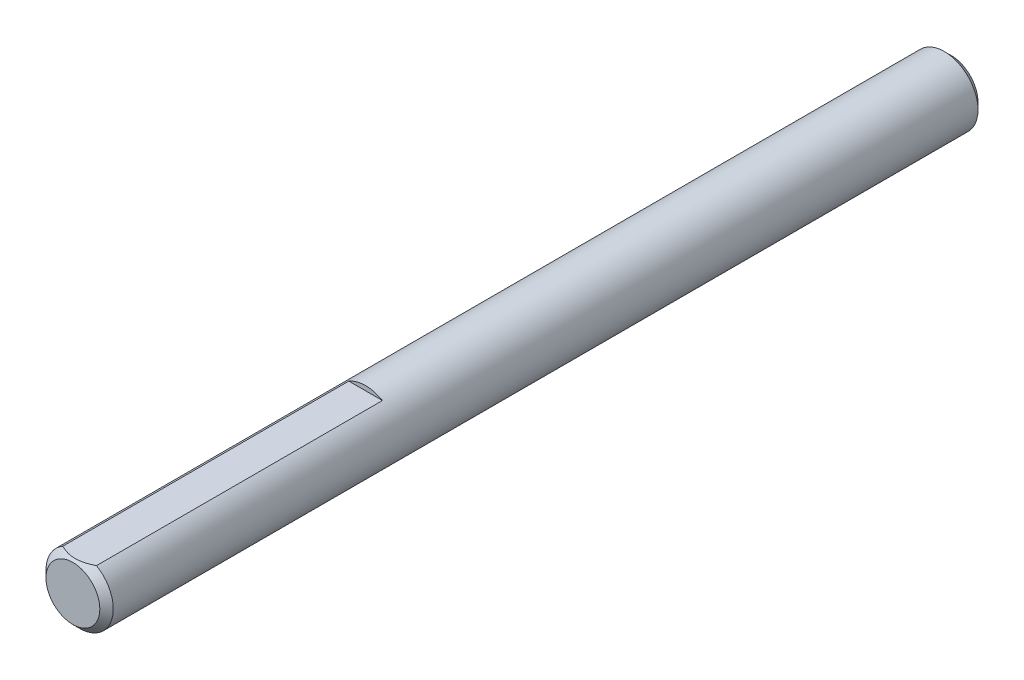
ISO-10303-21;
HEADER;
FILE_DESCRIPTION(('STEP AP214'),'2;1');
FILE_NAME('part.step','',(''),(''),'','','');
FILE_SCHEMA(('AUTOMOTIVE_DESIGN { 1 0 10303 214 1 1 1 1 }'));
ENDSEC;
DATA;
#1=APPLICATION_CONTEXT('core data for automotive mechanical design processes');
#2=APPLICATION_PROTOCOL_DEFINITION('international standard','automotive_design',2000,#1);
#3=PRODUCT_CONTEXT('',#1,'mechanical');
#4=PRODUCT('Part','Part','',(#3));
#5=PRODUCT_RELATED_PRODUCT_CATEGORY('part','',(#4));
#6=PRODUCT_DEFINITION_FORMATION('','',#4);
#7=PRODUCT_DEFINITION_CONTEXT('part definition',#1,'design');
#8=PRODUCT_DEFINITION('design','',#6,#7);
#9=PRODUCT_DEFINITION_SHAPE('','',#8);
#10=(LENGTH_UNIT() NAMED_UNIT(*) SI_UNIT(.MILLI.,.METRE.));
#11=(NAMED_UNIT(*) PLANE_ANGLE_UNIT() SI_UNIT($,.RADIAN.));
#12=(NAMED_UNIT(*) SI_UNIT($,.STERADIAN.) SOLID_ANGLE_UNIT());
#13=UNCERTAINTY_MEASURE_WITH_UNIT(LENGTH_MEASURE(1.E-05),#10,'distance_accuracy_value','');
#14=(GEOMETRIC_REPRESENTATION_CONTEXT(3) GLOBAL_UNCERTAINTY_ASSIGNED_CONTEXT((#13)) GLOBAL_UNIT_ASSIGNED_CONTEXT((#10,
#11,#12)) REPRESENTATION_CONTEXT('',''));
#15=CARTESIAN_POINT('',(0.,0.,0.));
#16=DIRECTION('',(0.,0.,1.));
#17=DIRECTION('',(1.,0.,0.));
#18=AXIS2_PLACEMENT_3D('',#15,#16,#17);
#19=CARTESIAN_POINT('',(0.,0.,38.1));
#20=DIRECTION('',(0.,0.,-1.));
#21=DIRECTION('',(-1.,0.,0.));
#22=AXIS2_PLACEMENT_3D('',#19,#20,#21);
#23=CYLINDRICAL_SURFACE('',#22,2.921);
#24=CARTESIAN_POINT('',(0.,0.,-37.5157999999999));
#25=DIRECTION('',(0.,0.,1.));
#26=DIRECTION('',(1.,0.,0.));
#27=AXIS2_PLACEMENT_3D('',#24,#25,#26);
#28=CIRCLE('',#27,2.921);
#29=CARTESIAN_POINT('',(2.921,0.,-37.5157999999999));
#30=VERTEX_POINT('',#29);
#31=EDGE_CURVE('E77',#30,#30,#28,.T.);
#32=ORIENTED_EDGE('',*,*,#31,.T.);
#33=EDGE_LOOP('',(#32));
#34=FACE_BOUND('',#33,.T.);
#35=DIRECTION('',(0.,0.,-1.));
#36=VECTOR('',#35,1.);
#37=CARTESIAN_POINT('',(1.4605,2.52966020445435,38.1));
#38=LINE('',#37,#36);
#39=CARTESIAN_POINT('',(1.4605,2.52966020445435,37.5158));
#40=VERTEX_POINT('',#39);
#41=CARTESIAN_POINT('',(1.4605,2.52966020445435,12.7));
#42=VERTEX_POINT('',#41);
#43=EDGE_CURVE('E65',#40,#42,#38,.T.);
#44=ORIENTED_EDGE('',*,*,#43,.F.);
#45=CARTESIAN_POINT('',(0.,0.,37.5158));
#46=DIRECTION('',(0.,0.,1.));
#47=DIRECTION('',(1.,0.,0.));
#48=AXIS2_PLACEMENT_3D('',#45,#46,#47);
#49=CIRCLE('',#48,2.921);
#50=CARTESIAN_POINT('',(-1.4605,2.52966020445435,37.5158));
#51=VERTEX_POINT('',#50);
#52=EDGE_CURVE('E75',#40,#51,#49,.F.);
#53=ORIENTED_EDGE('',*,*,#52,.T.);
#54=DIRECTION('',(0.,0.,-1.));
#55=VECTOR('',#54,1.);
#56=CARTESIAN_POINT('',(-1.4605,2.52966020445435,38.1));
#57=LINE('',#56,#55);
#58=CARTESIAN_POINT('',(-1.4605,2.52966020445435,12.7));
#59=VERTEX_POINT('',#58);
#60=EDGE_CURVE('E54',#51,#59,#57,.T.);
#61=ORIENTED_EDGE('',*,*,#60,.T.);
#62=CARTESIAN_POINT('',(0.,0.,12.7));
#63=DIRECTION('',(0.,0.,1.));
#64=DIRECTION('',(1.,0.,0.));
#65=AXIS2_PLACEMENT_3D('',#62,#63,#64);
#66=CIRCLE('',#65,2.921);
#67=EDGE_CURVE('E68',#42,#59,#66,.T.);
#68=ORIENTED_EDGE('',*,*,#67,.F.);
#69=EDGE_LOOP('',(#44,#53,#61,#68));
#70=FACE_BOUND('',#69,.T.);
#71=ADVANCED_FACE('F33',(#34,#70),#23,.T.);
#72=CARTESIAN_POINT('',(0.,0.,38.1));
#73=DIRECTION('',(0.,0.,-1.));
#74=DIRECTION('',(-1.,0.,0.));
#75=AXIS2_PLACEMENT_3D('',#72,#73,#74);
#76=CONICAL_SURFACE('',#75,2.33680000000003,0.785398163397449);
#77=CARTESIAN_POINT('',(0.,0.,38.1));
#78=DIRECTION('',(0.,0.,1.));
#79=DIRECTION('',(1.,0.,0.));
#80=AXIS2_PLACEMENT_3D('',#77,#78,#79);
#81=CIRCLE('',#80,2.33680000000003);
#82=CARTESIAN_POINT('',(2.33680000000003,0.,38.1));
#83=VERTEX_POINT('',#82);
#84=EDGE_CURVE('E47',#83,#83,#81,.T.);
#85=ORIENTED_EDGE('',*,*,#84,.F.);
#86=EDGE_LOOP('',(#85));
#87=FACE_BOUND('',#86,.T.);
#88=ORIENTED_EDGE('',*,*,#52,.F.);
#89=CARTESIAN_POINT('',(-2.97064444405832,2.52966020445435,36.5350171814651));
#90=CARTESIAN_POINT('',(-2.89856717586097,2.52966020445435,36.5898812025823));
#91=CARTESIAN_POINT('',(-2.82609288879163,2.52966020445435,36.644232003463));
#92=CARTESIAN_POINT('',(-2.68019120123314,2.52966020445435,36.7516753402089));
#93=CARTESIAN_POINT('',(-2.60676357185791,2.52966020445435,36.8047675649238));
#94=CARTESIAN_POINT('',(-2.45825897824527,2.52966020445435,36.9098397439807));
#95=CARTESIAN_POINT('',(-2.38317364852794,2.52966020445435,36.9618079143742));
#96=CARTESIAN_POINT('',(-2.23173886692391,2.52966020445435,37.0638624331877));
#97=CARTESIAN_POINT('',(-2.15538950384588,2.52966020445435,37.1139489130103));
#98=CARTESIAN_POINT('',(-1.9965973196425,2.52966020445435,37.2147519614724));
#99=CARTESIAN_POINT('',(-1.91406366642257,2.52966020445435,37.265326168513));
#100=CARTESIAN_POINT('',(-1.74708832304396,2.52966020445435,37.3632152337421));
#101=CARTESIAN_POINT('',(-1.66264688523584,2.52966020445435,37.4105305196881));
#102=CARTESIAN_POINT('',(-1.49181459539415,2.52966020445435,37.5009096206473));
#103=CARTESIAN_POINT('',(-1.40543009648694,2.52966020445435,37.5439853501626));
#104=CARTESIAN_POINT('',(-1.23026730046332,2.52966020445435,37.6249127501135));
#105=CARTESIAN_POINT('',(-1.14149012983691,2.52966020445435,37.6627668293067));
#106=CARTESIAN_POINT('',(-0.969355633398887,2.52966020445435,37.7288319222521));
#107=CARTESIAN_POINT('',(-0.886214311541549,2.52966020445435,37.7575999604554));
#108=CARTESIAN_POINT('',(-0.717879436348214,2.52966020445435,37.8084733323625));
#109=CARTESIAN_POINT('',(-0.632685746877104,2.52966020445435,37.8305782227731));
#110=CARTESIAN_POINT('',(-0.462200116780222,2.52966020445435,37.8665852275739));
#111=CARTESIAN_POINT('',(-0.376939129535014,2.52966020445435,37.880631478369));
#112=CARTESIAN_POINT('',(-0.205441824230444,2.52966020445435,37.9002393346671));
#113=CARTESIAN_POINT('',(-0.119205691162377,2.52966020445435,37.905802523133));
#114=CARTESIAN_POINT('',(0.0499888954295438,2.52966020445435,37.9080047264286));
#115=CARTESIAN_POINT('',(0.132942983148177,2.52966020445435,37.9049858393296));
#116=CARTESIAN_POINT('',(0.298167900087537,2.52966020445435,37.8909592302067));
#117=CARTESIAN_POINT('',(0.380438663945115,2.52966020445435,37.8799507526429));
#118=CARTESIAN_POINT('',(0.545096380742143,2.52966020445435,37.8503686016533));
#119=CARTESIAN_POINT('',(0.627459483188692,2.52966020445435,37.8316641337612));
#120=CARTESIAN_POINT('',(0.790375104046713,2.52966020445435,37.7877015821177));
#121=CARTESIAN_POINT('',(0.870927753001677,2.52966020445435,37.7624439725412));
#122=CARTESIAN_POINT('',(1.12198252866026,2.52966020445435,37.6741591236146));
#123=CARTESIAN_POINT('',(1.28899906491653,2.52966020445435,37.6011846965174));
#124=CARTESIAN_POINT('',(1.53341818330671,2.52966020445435,37.4795096664077));
#125=CARTESIAN_POINT('',(1.61402489314215,2.52966020445435,37.4368204482339));
#126=CARTESIAN_POINT('',(1.77340995348352,2.52966020445435,37.3481476987463));
#127=CARTESIAN_POINT('',(1.8521886264902,2.52966020445435,37.3021647544496));
#128=CARTESIAN_POINT('',(2.00426769542878,2.52966020445435,37.2099127358416));
#129=CARTESIAN_POINT('',(2.07764609468898,2.52966020445435,37.1637707943164));
#130=CARTESIAN_POINT('',(2.22314429148799,2.52966020445435,37.0695339603416));
#131=CARTESIAN_POINT('',(2.29526399353125,2.52966020445435,37.0214389206261));
#132=CARTESIAN_POINT('',(2.4378250827794,2.52966020445435,36.924040475051));
#133=CARTESIAN_POINT('',(2.50827532225243,2.52966020445435,36.874749972432));
#134=CARTESIAN_POINT('',(2.64821121371635,2.52966020445435,36.7748569228156));
#135=CARTESIAN_POINT('',(2.71769712597722,2.52966020445435,36.7242547408444));
#136=CARTESIAN_POINT('',(2.78677909292055,2.52966020445435,36.673115839136));
#137=B_SPLINE_CURVE_WITH_KNOTS('',3,(#89,#90,#91,#92,#93,#94,#95,#96,#97,#98,#99,#100,#101,#102,
#103,#104,#105,#106,#107,#108,#109,#110,#111,#112,#113,#114,#115,#116,#117,#118,#119,#120,#121,
#122,#123,#124,#125,#126,#127,#128,#129,#130,#131,#132,#133,#134,#135,#136),.UNSPECIFIED.,.F.,
.F.,(4,2,2,2,2,2,2,2,2,2,2,2,2,2,2,2,2,2,2,2,2,2,2,4),(0.,0.271752773329514,0.543572044218886,
0.817494401893116,1.09139759527145,1.38172762724175,1.67201947832799,1.96147071231236,
2.25078797211441,2.51449123514464,2.77821203823926,3.03705577600694,3.29585120689864,
3.54447688190014,3.79312607138612,4.04618811156046,4.29923184566922,4.84432505542007,
5.1179415860195,5.39150947266789,5.65151881703609,5.9115478029317,6.16947579519708,
6.42733276359083),.UNSPECIFIED.);
#138=EDGE_CURVE('E11',#40,#51,#137,.F.);
#139=ORIENTED_EDGE('',*,*,#138,.T.);
#140=EDGE_LOOP('',(#88,#139));
#141=FACE_BOUND('',#140,.T.);
#142=ADVANCED_FACE('F35',(#87,#141),#76,.T.);
#143=CARTESIAN_POINT('',(0.,0.,38.1));
#144=DIRECTION('',(0.,0.,1.));
#145=DIRECTION('',(1.,0.,0.));
#146=AXIS2_PLACEMENT_3D('',#143,#144,#145);
#147=PLANE('',#146);
#148=ORIENTED_EDGE('',*,*,#84,.T.);
#149=EDGE_LOOP('',(#148));
#150=FACE_BOUND('',#149,.T.);
#151=ADVANCED_FACE('F88',(#150),#147,.T.);
#152=CARTESIAN_POINT('',(0.,0.,-38.1));
#153=DIRECTION('',(0.,0.,1.));
#154=DIRECTION('',(1.,0.,0.));
#155=AXIS2_PLACEMENT_3D('',#152,#153,#154);
#156=PLANE('',#155);
#157=CARTESIAN_POINT('',(0.,0.,-38.1));
#158=DIRECTION('',(0.,0.,1.));
#159=DIRECTION('',(1.,0.,0.));
#160=AXIS2_PLACEMENT_3D('',#157,#158,#159);
#161=CIRCLE('',#160,2.33679999999993);
#162=CARTESIAN_POINT('',(2.33679999999993,0.,-38.1));
#163=VERTEX_POINT('',#162);
#164=EDGE_CURVE('E83',#163,#163,#161,.F.);
#165=ORIENTED_EDGE('',*,*,#164,.T.);
#166=EDGE_LOOP('',(#165));
#167=FACE_BOUND('',#166,.T.);
#168=ADVANCED_FACE('F96',(#167),#156,.F.);
#169=CARTESIAN_POINT('',(0.,0.,-37.5157999999999));
#170=DIRECTION('',(0.,0.,1.));
#171=DIRECTION('',(1.,0.,0.));
#172=AXIS2_PLACEMENT_3D('',#169,#170,#171);
#173=CONICAL_SURFACE('',#172,2.921,0.785398163397443);
#174=ORIENTED_EDGE('',*,*,#164,.F.);
#175=EDGE_LOOP('',(#174));
#176=FACE_BOUND('',#175,.T.);
#177=ORIENTED_EDGE('',*,*,#31,.F.);
#178=EDGE_LOOP('',(#177));
#179=FACE_BOUND('',#178,.T.);
#180=ADVANCED_FACE('F103',(#176,#179),#173,.T.);
#181=CARTESIAN_POINT('',(-1.4605,2.52966020445435,38.1));
#182=DIRECTION('',(0.,1.,0.));
#183=DIRECTION('',(0.,0.,1.));
#184=AXIS2_PLACEMENT_3D('',#181,#182,#183);
#185=PLANE('',#184);
#186=ORIENTED_EDGE('',*,*,#43,.T.);
#187=DIRECTION('',(1.,0.,0.));
#188=VECTOR('',#187,1.);
#189=CARTESIAN_POINT('',(-1.4605,2.52966020445435,12.7));
#190=LINE('',#189,#188);
#191=EDGE_CURVE('E62',#59,#42,#190,.T.);
#192=ORIENTED_EDGE('',*,*,#191,.F.);
#193=ORIENTED_EDGE('',*,*,#60,.F.);
#194=ORIENTED_EDGE('',*,*,#138,.F.);
#195=EDGE_LOOP('',(#186,#192,#193,#194));
#196=FACE_BOUND('',#195,.T.);
#197=ADVANCED_FACE('F64',(#196),#185,.T.);
#198=CARTESIAN_POINT('',(0.,0.,12.7));
#199=DIRECTION('',(0.,0.,1.));
#200=DIRECTION('',(1.,0.,0.));
#201=AXIS2_PLACEMENT_3D('',#198,#199,#200);
#202=PLANE('',#201);
#203=ORIENTED_EDGE('',*,*,#67,.T.);
#204=ORIENTED_EDGE('',*,*,#191,.T.);
#205=EDGE_LOOP('',(#203,#204));
#206=FACE_BOUND('',#205,.T.);
#207=ADVANCED_FACE('F70',(#206),#202,.T.);
#208=CLOSED_SHELL('',(#71,#142,#151,#168,#180,#197,#207));
#209=MANIFOLD_SOLID_BREP('B2',#208);
#210=ADVANCED_BREP_SHAPE_REPRESENTATION('',(#18,#209),#14);
#211=SHAPE_DEFINITION_REPRESENTATION(#9,#210);
ENDSEC;
END-ISO-10303-21;
